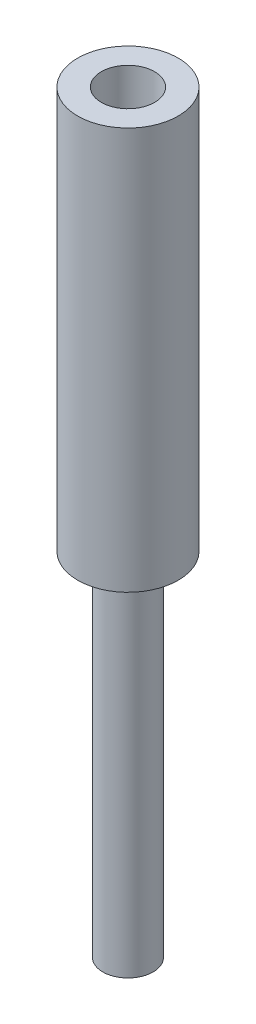
ISO-10303-21;
HEADER;
FILE_DESCRIPTION(('STEP AP214'),'2;1');
FILE_NAME('part.step','',(''),(''),'','','');
FILE_SCHEMA(('AUTOMOTIVE_DESIGN { 1 0 10303 214 1 1 1 1 }'));
ENDSEC;
DATA;
#1=APPLICATION_CONTEXT('core data for automotive mechanical design processes');
#2=APPLICATION_PROTOCOL_DEFINITION('international standard','automotive_design',2000,#1);
#3=PRODUCT_CONTEXT('',#1,'mechanical');
#4=PRODUCT('Part','Part','',(#3));
#5=PRODUCT_RELATED_PRODUCT_CATEGORY('part','',(#4));
#6=PRODUCT_DEFINITION_FORMATION('','',#4);
#7=PRODUCT_DEFINITION_CONTEXT('part definition',#1,'design');
#8=PRODUCT_DEFINITION('design','',#6,#7);
#9=PRODUCT_DEFINITION_SHAPE('','',#8);
#10=(LENGTH_UNIT() NAMED_UNIT(*) SI_UNIT(.MILLI.,.METRE.));
#11=(NAMED_UNIT(*) PLANE_ANGLE_UNIT() SI_UNIT($,.RADIAN.));
#12=(NAMED_UNIT(*) SI_UNIT($,.STERADIAN.) SOLID_ANGLE_UNIT());
#13=UNCERTAINTY_MEASURE_WITH_UNIT(LENGTH_MEASURE(1.E-05),#10,'distance_accuracy_value','');
#14=(GEOMETRIC_REPRESENTATION_CONTEXT(3) GLOBAL_UNCERTAINTY_ASSIGNED_CONTEXT((#13)) GLOBAL_UNIT_ASSIGNED_CONTEXT((#10,
#11,#12)) REPRESENTATION_CONTEXT('',''));
#15=CARTESIAN_POINT('',(0.,0.,0.));
#16=DIRECTION('',(0.,0.,1.));
#17=DIRECTION('',(1.,0.,0.));
#18=AXIS2_PLACEMENT_3D('',#15,#16,#17);
#19=CARTESIAN_POINT('',(0.,80.,0.));
#20=DIRECTION('',(0.,-1.,0.));
#21=DIRECTION('',(0.,0.,-1.));
#22=AXIS2_PLACEMENT_3D('',#19,#20,#21);
#23=CYLINDRICAL_SURFACE('',#22,10.);
#24=CARTESIAN_POINT('',(0.,80.,0.));
#25=DIRECTION('',(0.,1.,0.));
#26=DIRECTION('',(0.,0.,1.));
#27=AXIS2_PLACEMENT_3D('',#24,#25,#26);
#28=CIRCLE('',#27,10.);
#29=CARTESIAN_POINT('',(0.,80.,10.));
#30=VERTEX_POINT('',#29);
#31=EDGE_CURVE('E37',#30,#30,#28,.T.);
#32=ORIENTED_EDGE('',*,*,#31,.F.);
#33=EDGE_LOOP('',(#32));
#34=FACE_BOUND('',#33,.T.);
#35=CARTESIAN_POINT('',(0.,0.,0.));
#36=DIRECTION('',(0.,1.,0.));
#37=DIRECTION('',(0.,0.,1.));
#38=AXIS2_PLACEMENT_3D('',#35,#36,#37);
#39=CIRCLE('',#38,10.);
#40=CARTESIAN_POINT('',(0.,0.,10.));
#41=VERTEX_POINT('',#40);
#42=EDGE_CURVE('E41',#41,#41,#39,.T.);
#43=ORIENTED_EDGE('',*,*,#42,.T.);
#44=EDGE_LOOP('',(#43));
#45=FACE_BOUND('',#44,.T.);
#46=ADVANCED_FACE('F31',(#34,#45),#23,.T.);
#47=CARTESIAN_POINT('',(0.,80.,0.));
#48=DIRECTION('',(0.,1.,0.));
#49=DIRECTION('',(0.,0.,1.));
#50=AXIS2_PLACEMENT_3D('',#47,#48,#49);
#51=PLANE('',#50);
#52=CARTESIAN_POINT('',(0.,80.,0.));
#53=DIRECTION('',(0.,1.,0.));
#54=DIRECTION('',(0.,0.,1.));
#55=AXIS2_PLACEMENT_3D('',#52,#53,#54);
#56=CIRCLE('',#55,5.3);
#57=CARTESIAN_POINT('',(0.,80.,5.3));
#58=VERTEX_POINT('',#57);
#59=EDGE_CURVE('E48',#58,#58,#56,.T.);
#60=ORIENTED_EDGE('',*,*,#59,.F.);
#61=EDGE_LOOP('',(#60));
#62=FACE_BOUND('',#61,.T.);
#63=ORIENTED_EDGE('',*,*,#31,.T.);
#64=EDGE_LOOP('',(#63));
#65=FACE_BOUND('',#64,.T.);
#66=ADVANCED_FACE('F72',(#62,#65),#51,.T.);
#67=CARTESIAN_POINT('',(0.,0.,0.));
#68=DIRECTION('',(0.,1.,0.));
#69=DIRECTION('',(0.,0.,1.));
#70=AXIS2_PLACEMENT_3D('',#67,#68,#69);
#71=PLANE('',#70);
#72=CARTESIAN_POINT('',(0.,0.,0.));
#73=DIRECTION('',(0.,1.,0.));
#74=DIRECTION('',(0.,0.,1.));
#75=AXIS2_PLACEMENT_3D('',#72,#73,#74);
#76=CIRCLE('',#75,5.);
#77=CARTESIAN_POINT('',(0.,0.,5.));
#78=VERTEX_POINT('',#77);
#79=EDGE_CURVE('E10',#78,#78,#76,.F.);
#80=ORIENTED_EDGE('',*,*,#79,.F.);
#81=EDGE_LOOP('',(#80));
#82=FACE_BOUND('',#81,.T.);
#83=ORIENTED_EDGE('',*,*,#42,.F.);
#84=EDGE_LOOP('',(#83));
#85=FACE_BOUND('',#84,.T.);
#86=ADVANCED_FACE('F77',(#82,#85),#71,.F.);
#87=CARTESIAN_POINT('',(0.,10.,0.));
#88=DIRECTION('',(0.,1.,0.));
#89=DIRECTION('',(0.,0.,1.));
#90=AXIS2_PLACEMENT_3D('',#87,#88,#89);
#91=CYLINDRICAL_SURFACE('',#90,5.3);
#92=CARTESIAN_POINT('',(0.,10.,0.));
#93=DIRECTION('',(0.,1.,0.));
#94=DIRECTION('',(0.,0.,1.));
#95=AXIS2_PLACEMENT_3D('',#92,#93,#94);
#96=CIRCLE('',#95,5.3);
#97=CARTESIAN_POINT('',(0.,10.,5.3));
#98=VERTEX_POINT('',#97);
#99=EDGE_CURVE('E46',#98,#98,#96,.T.);
#100=ORIENTED_EDGE('',*,*,#99,.F.);
#101=EDGE_LOOP('',(#100));
#102=FACE_BOUND('',#101,.T.);
#103=ORIENTED_EDGE('',*,*,#59,.T.);
#104=EDGE_LOOP('',(#103));
#105=FACE_BOUND('',#104,.T.);
#106=ADVANCED_FACE('F68',(#102,#105),#91,.F.);
#107=CARTESIAN_POINT('',(0.,10.,0.));
#108=DIRECTION('',(0.,1.,0.));
#109=DIRECTION('',(0.,0.,1.));
#110=AXIS2_PLACEMENT_3D('',#107,#108,#109);
#111=PLANE('',#110);
#112=ORIENTED_EDGE('',*,*,#99,.T.);
#113=EDGE_LOOP('',(#112));
#114=FACE_BOUND('',#113,.T.);
#115=ADVANCED_FACE('F61',(#114),#111,.T.);
#116=CARTESIAN_POINT('',(0.,-70.,0.));
#117=DIRECTION('',(0.,1.,0.));
#118=DIRECTION('',(0.,0.,1.));
#119=AXIS2_PLACEMENT_3D('',#116,#117,#118);
#120=CYLINDRICAL_SURFACE('',#119,5.);
#121=CARTESIAN_POINT('',(0.,-70.,0.));
#122=DIRECTION('',(0.,-1.,0.));
#123=DIRECTION('',(0.,0.,-1.));
#124=AXIS2_PLACEMENT_3D('',#121,#122,#123);
#125=CIRCLE('',#124,5.);
#126=CARTESIAN_POINT('',(0.,-70.,-5.));
#127=VERTEX_POINT('',#126);
#128=EDGE_CURVE('E51',#127,#127,#125,.T.);
#129=ORIENTED_EDGE('',*,*,#128,.F.);
#130=EDGE_LOOP('',(#129));
#131=FACE_BOUND('',#130,.T.);
#132=ORIENTED_EDGE('',*,*,#79,.T.);
#133=EDGE_LOOP('',(#132));
#134=FACE_BOUND('',#133,.T.);
#135=ADVANCED_FACE('F59',(#131,#134),#120,.T.);
#136=CARTESIAN_POINT('',(0.,-70.,0.));
#137=DIRECTION('',(0.,-1.,0.));
#138=DIRECTION('',(0.,0.,-1.));
#139=AXIS2_PLACEMENT_3D('',#136,#137,#138);
#140=PLANE('',#139);
#141=ORIENTED_EDGE('',*,*,#128,.T.);
#142=EDGE_LOOP('',(#141));
#143=FACE_BOUND('',#142,.T.);
#144=ADVANCED_FACE('F57',(#143),#140,.T.);
#145=CLOSED_SHELL('',(#46,#66,#86,#106,#115,#135,#144));
#146=MANIFOLD_SOLID_BREP('B2',#145);
#147=ADVANCED_BREP_SHAPE_REPRESENTATION('',(#18,#146),#14);
#148=SHAPE_DEFINITION_REPRESENTATION(#9,#147);
ENDSEC;
END-ISO-10303-21;
